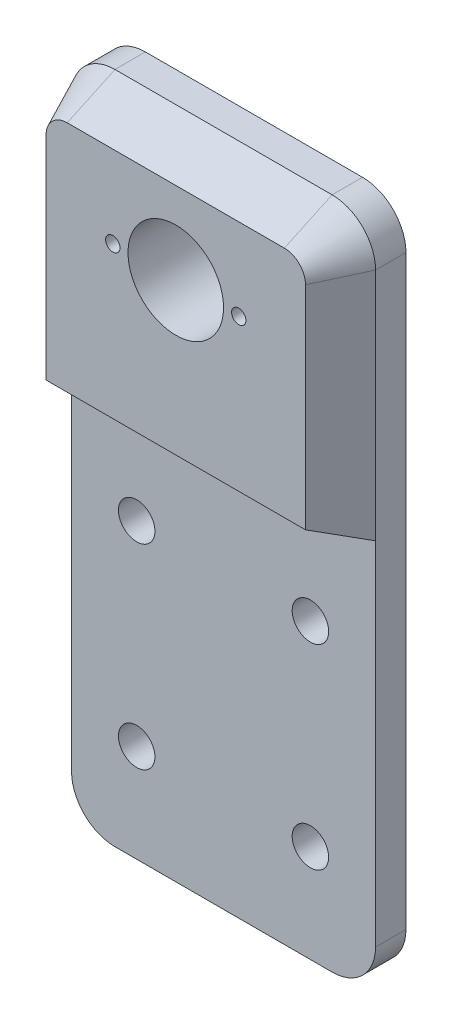
ISO-10303-21;
HEADER;
FILE_DESCRIPTION(('STEP AP214'),'2;1');
FILE_NAME('part.step','',(''),(''),'','','');
FILE_SCHEMA(('AUTOMOTIVE_DESIGN { 1 0 10303 214 1 1 1 1 }'));
ENDSEC;
DATA;
#1=APPLICATION_CONTEXT('core data for automotive mechanical design processes');
#2=APPLICATION_PROTOCOL_DEFINITION('international standard','automotive_design',2000,#1);
#3=PRODUCT_CONTEXT('',#1,'mechanical');
#4=PRODUCT('Part','Part','',(#3));
#5=PRODUCT_RELATED_PRODUCT_CATEGORY('part','',(#4));
#6=PRODUCT_DEFINITION_FORMATION('','',#4);
#7=PRODUCT_DEFINITION_CONTEXT('part definition',#1,'design');
#8=PRODUCT_DEFINITION('design','',#6,#7);
#9=PRODUCT_DEFINITION_SHAPE('','',#8);
#10=(LENGTH_UNIT() NAMED_UNIT(*) SI_UNIT(.MILLI.,.METRE.));
#11=(NAMED_UNIT(*) PLANE_ANGLE_UNIT() SI_UNIT($,.RADIAN.));
#12=(NAMED_UNIT(*) SI_UNIT($,.STERADIAN.) SOLID_ANGLE_UNIT());
#13=UNCERTAINTY_MEASURE_WITH_UNIT(LENGTH_MEASURE(1.E-05),#10,'distance_accuracy_value','');
#14=(GEOMETRIC_REPRESENTATION_CONTEXT(3) GLOBAL_UNCERTAINTY_ASSIGNED_CONTEXT((#13)) GLOBAL_UNIT_ASSIGNED_CONTEXT((#10,
#11,#12)) REPRESENTATION_CONTEXT('',''));
#15=CARTESIAN_POINT('',(0.,0.,0.));
#16=DIRECTION('',(0.,0.,1.));
#17=DIRECTION('',(1.,0.,0.));
#18=AXIS2_PLACEMENT_3D('',#15,#16,#17);
#19=CARTESIAN_POINT('',(-25.,70.,0.));
#20=DIRECTION('',(0.,0.,-1.));
#21=DIRECTION('',(-1.,0.,0.));
#22=AXIS2_PLACEMENT_3D('',#19,#20,#21);
#23=PLANE('',#22);
#24=CARTESIAN_POINT('',(-20.,-7.49999999999999,0.));
#25=DIRECTION('',(0.,0.,1.));
#26=DIRECTION('',(1.,0.,0.));
#27=AXIS2_PLACEMENT_3D('',#24,#25,#26);
#28=CIRCLE('',#27,4.2);
#29=CARTESIAN_POINT('',(-15.8,-7.49999999999999,0.));
#30=VERTEX_POINT('',#29);
#31=EDGE_CURVE('E248',#30,#30,#28,.T.);
#32=ORIENTED_EDGE('',*,*,#31,.F.);
#33=EDGE_LOOP('',(#32));
#34=FACE_BOUND('',#33,.T.);
#35=CARTESIAN_POINT('',(20.,-7.49999999999999,0.));
#36=DIRECTION('',(0.,0.,1.));
#37=DIRECTION('',(1.,0.,0.));
#38=AXIS2_PLACEMENT_3D('',#35,#36,#37);
#39=CIRCLE('',#38,4.2);
#40=CARTESIAN_POINT('',(24.2,-7.49999999999999,0.));
#41=VERTEX_POINT('',#40);
#42=EDGE_CURVE('E242',#41,#41,#39,.T.);
#43=ORIENTED_EDGE('',*,*,#42,.F.);
#44=EDGE_LOOP('',(#43));
#45=FACE_BOUND('',#44,.T.);
#46=CARTESIAN_POINT('',(20.,-52.5,0.));
#47=DIRECTION('',(0.,0.,1.));
#48=DIRECTION('',(1.,0.,0.));
#49=AXIS2_PLACEMENT_3D('',#46,#47,#48);
#50=CIRCLE('',#49,4.2);
#51=CARTESIAN_POINT('',(24.2,-52.5,0.));
#52=VERTEX_POINT('',#51);
#53=EDGE_CURVE('E235',#52,#52,#50,.T.);
#54=ORIENTED_EDGE('',*,*,#53,.F.);
#55=EDGE_LOOP('',(#54));
#56=FACE_BOUND('',#55,.T.);
#57=CARTESIAN_POINT('',(-20.,-52.5,0.));
#58=DIRECTION('',(0.,0.,1.));
#59=DIRECTION('',(1.,0.,0.));
#60=AXIS2_PLACEMENT_3D('',#57,#58,#59);
#61=CIRCLE('',#60,4.2);
#62=CARTESIAN_POINT('',(-15.8,-52.5,0.));
#63=VERTEX_POINT('',#62);
#64=EDGE_CURVE('E236',#63,#63,#61,.T.);
#65=ORIENTED_EDGE('',*,*,#64,.F.);
#66=EDGE_LOOP('',(#65));
#67=FACE_BOUND('',#66,.T.);
#68=DIRECTION('',(1.,0.,0.));
#69=VECTOR('',#68,1.);
#70=CARTESIAN_POINT('',(-35.,16.,0.));
#71=LINE('',#70,#69);
#72=CARTESIAN_POINT('',(-35.,16.,0.));
#73=VERTEX_POINT('',#72);
#74=CARTESIAN_POINT('',(35.,16.,0.));
#75=VERTEX_POINT('',#74);
#76=EDGE_CURVE('E58',#73,#75,#71,.T.);
#77=ORIENTED_EDGE('',*,*,#76,.F.);
#78=DIRECTION('',(0.,-1.,0.));
#79=VECTOR('',#78,1.);
#80=CARTESIAN_POINT('',(-35.,70.,0.));
#81=LINE('',#80,#79);
#82=CARTESIAN_POINT('',(-35.,-64.9999999999999,0.));
#83=VERTEX_POINT('',#82);
#84=EDGE_CURVE('E154',#73,#83,#81,.T.);
#85=ORIENTED_EDGE('',*,*,#84,.T.);
#86=CARTESIAN_POINT('',(-25.,-65.,0.));
#87=DIRECTION('',(0.,0.,1.));
#88=DIRECTION('',(-1.,0.,0.));
#89=AXIS2_PLACEMENT_3D('',#86,#87,#88);
#90=CIRCLE('',#89,10.);
#91=CARTESIAN_POINT('',(-24.9999999999999,-75.,0.));
#92=VERTEX_POINT('',#91);
#93=EDGE_CURVE('E159',#83,#92,#90,.T.);
#94=ORIENTED_EDGE('',*,*,#93,.T.);
#95=DIRECTION('',(1.,0.,0.));
#96=VECTOR('',#95,1.);
#97=CARTESIAN_POINT('',(-24.9999999999999,-75.,0.));
#98=LINE('',#97,#96);
#99=CARTESIAN_POINT('',(24.9999999999999,-75.,0.));
#100=VERTEX_POINT('',#99);
#101=EDGE_CURVE('E162',#92,#100,#98,.T.);
#102=ORIENTED_EDGE('',*,*,#101,.T.);
#103=CARTESIAN_POINT('',(25.,-65.,0.));
#104=DIRECTION('',(0.,0.,1.));
#105=DIRECTION('',(-1.,0.,0.));
#106=AXIS2_PLACEMENT_3D('',#103,#104,#105);
#107=CIRCLE('',#106,10.);
#108=CARTESIAN_POINT('',(35.,-64.9999999999999,0.));
#109=VERTEX_POINT('',#108);
#110=EDGE_CURVE('E165',#100,#109,#107,.T.);
#111=ORIENTED_EDGE('',*,*,#110,.T.);
#112=DIRECTION('',(0.,1.,0.));
#113=VECTOR('',#112,1.);
#114=CARTESIAN_POINT('',(35.,70.,0.));
#115=LINE('',#114,#113);
#116=EDGE_CURVE('E168',#109,#75,#115,.T.);
#117=ORIENTED_EDGE('',*,*,#116,.T.);
#118=EDGE_LOOP('',(#77,#85,#94,#102,#111,#117));
#119=FACE_BOUND('',#118,.T.);
#120=ADVANCED_FACE('F41',(#34,#45,#56,#67,#119),#23,.F.);
#121=CARTESIAN_POINT('',(-25.,70.,-7.));
#122=DIRECTION('',(0.,0.,1.));
#123=DIRECTION('',(1.,0.,0.));
#124=AXIS2_PLACEMENT_3D('',#121,#122,#123);
#125=CYLINDRICAL_SURFACE('',#124,10.);
#126=CARTESIAN_POINT('',(-25.,70.,0.));
#127=DIRECTION('',(0.,0.,1.));
#128=DIRECTION('',(-1.,0.,0.));
#129=AXIS2_PLACEMENT_3D('',#126,#127,#128);
#130=CIRCLE('',#129,10.);
#131=CARTESIAN_POINT('',(-25.,80.,0.));
#132=VERTEX_POINT('',#131);
#133=CARTESIAN_POINT('',(-35.,70.,0.));
#134=VERTEX_POINT('',#133);
#135=EDGE_CURVE('E151',#132,#134,#130,.T.);
#136=ORIENTED_EDGE('',*,*,#135,.F.);
#137=DIRECTION('',(0.,0.,1.));
#138=VECTOR('',#137,1.);
#139=CARTESIAN_POINT('',(-25.,80.,-7.));
#140=LINE('',#139,#138);
#141=CARTESIAN_POINT('',(-25.,80.,-7.));
#142=VERTEX_POINT('',#141);
#143=EDGE_CURVE('E11',#142,#132,#140,.T.);
#144=ORIENTED_EDGE('',*,*,#143,.F.);
#145=CARTESIAN_POINT('',(-25.,70.,-7.));
#146=DIRECTION('',(0.,0.,1.));
#147=DIRECTION('',(-1.,0.,0.));
#148=AXIS2_PLACEMENT_3D('',#145,#146,#147);
#149=CIRCLE('',#148,10.);
#150=CARTESIAN_POINT('',(-35.,70.,-7.));
#151=VERTEX_POINT('',#150);
#152=EDGE_CURVE('E173',#142,#151,#149,.T.);
#153=ORIENTED_EDGE('',*,*,#152,.T.);
#154=DIRECTION('',(0.,0.,1.));
#155=VECTOR('',#154,1.);
#156=CARTESIAN_POINT('',(-35.,70.,-7.));
#157=LINE('',#156,#155);
#158=EDGE_CURVE('E45',#151,#134,#157,.T.);
#159=ORIENTED_EDGE('',*,*,#158,.T.);
#160=EDGE_LOOP('',(#136,#144,#153,#159));
#161=FACE_BOUND('',#160,.T.);
#162=ADVANCED_FACE('F43',(#161),#125,.T.);
#163=CARTESIAN_POINT('',(-25.,80.,-7.));
#164=DIRECTION('',(0.,1.,0.));
#165=DIRECTION('',(0.,0.,1.));
#166=AXIS2_PLACEMENT_3D('',#163,#164,#165);
#167=PLANE('',#166);
#168=DIRECTION('',(-1.,0.,0.));
#169=VECTOR('',#168,1.);
#170=CARTESIAN_POINT('',(-25.,80.,0.));
#171=LINE('',#170,#169);
#172=CARTESIAN_POINT('',(25.,80.,0.));
#173=VERTEX_POINT('',#172);
#174=EDGE_CURVE('E171',#173,#132,#171,.T.);
#175=ORIENTED_EDGE('',*,*,#174,.F.);
#176=DIRECTION('',(0.,0.,1.));
#177=VECTOR('',#176,1.);
#178=CARTESIAN_POINT('',(25.,80.,-7.));
#179=LINE('',#178,#177);
#180=CARTESIAN_POINT('',(25.,80.,-7.));
#181=VERTEX_POINT('',#180);
#182=EDGE_CURVE('E50',#181,#173,#179,.T.);
#183=ORIENTED_EDGE('',*,*,#182,.F.);
#184=DIRECTION('',(-1.,0.,0.));
#185=VECTOR('',#184,1.);
#186=CARTESIAN_POINT('',(-25.,80.,-7.));
#187=LINE('',#186,#185);
#188=EDGE_CURVE('E140',#181,#142,#187,.T.);
#189=ORIENTED_EDGE('',*,*,#188,.T.);
#190=ORIENTED_EDGE('',*,*,#143,.T.);
#191=EDGE_LOOP('',(#175,#183,#189,#190));
#192=FACE_BOUND('',#191,.T.);
#193=ADVANCED_FACE('F299',(#192),#167,.T.);
#194=CARTESIAN_POINT('',(25.,70.,-7.));
#195=DIRECTION('',(0.,0.,1.));
#196=DIRECTION('',(1.,0.,0.));
#197=AXIS2_PLACEMENT_3D('',#194,#195,#196);
#198=CYLINDRICAL_SURFACE('',#197,9.99999999999999);
#199=CARTESIAN_POINT('',(25.,70.,0.));
#200=DIRECTION('',(0.,0.,1.));
#201=DIRECTION('',(1.,0.,0.));
#202=AXIS2_PLACEMENT_3D('',#199,#200,#201);
#203=CIRCLE('',#202,9.99999999999999);
#204=CARTESIAN_POINT('',(35.,70.,0.));
#205=VERTEX_POINT('',#204);
#206=EDGE_CURVE('E127',#205,#173,#203,.T.);
#207=ORIENTED_EDGE('',*,*,#206,.F.);
#208=DIRECTION('',(0.,0.,1.));
#209=VECTOR('',#208,1.);
#210=CARTESIAN_POINT('',(35.,70.,-7.));
#211=LINE('',#210,#209);
#212=CARTESIAN_POINT('',(35.,70.,-7.));
#213=VERTEX_POINT('',#212);
#214=EDGE_CURVE('E121',#213,#205,#211,.T.);
#215=ORIENTED_EDGE('',*,*,#214,.F.);
#216=CARTESIAN_POINT('',(25.,70.,-7.));
#217=DIRECTION('',(0.,0.,1.));
#218=DIRECTION('',(1.,0.,0.));
#219=AXIS2_PLACEMENT_3D('',#216,#217,#218);
#220=CIRCLE('',#219,9.99999999999999);
#221=EDGE_CURVE('E124',#213,#181,#220,.T.);
#222=ORIENTED_EDGE('',*,*,#221,.T.);
#223=ORIENTED_EDGE('',*,*,#182,.T.);
#224=EDGE_LOOP('',(#207,#215,#222,#223));
#225=FACE_BOUND('',#224,.T.);
#226=ADVANCED_FACE('F123',(#225),#198,.T.);
#227=CARTESIAN_POINT('',(35.,70.,-7.));
#228=DIRECTION('',(1.,0.,0.));
#229=DIRECTION('',(0.,1.,0.));
#230=AXIS2_PLACEMENT_3D('',#227,#228,#229);
#231=PLANE('',#230);
#232=ORIENTED_EDGE('',*,*,#116,.F.);
#233=DIRECTION('',(0.,0.,1.));
#234=VECTOR('',#233,1.);
#235=CARTESIAN_POINT('',(35.,-64.9999999999999,-7.));
#236=LINE('',#235,#234);
#237=CARTESIAN_POINT('',(35.,-64.9999999999999,-7.));
#238=VERTEX_POINT('',#237);
#239=EDGE_CURVE('E132',#238,#109,#236,.T.);
#240=ORIENTED_EDGE('',*,*,#239,.F.);
#241=DIRECTION('',(0.,1.,0.));
#242=VECTOR('',#241,1.);
#243=CARTESIAN_POINT('',(35.,70.,-7.));
#244=LINE('',#243,#242);
#245=EDGE_CURVE('E138',#238,#213,#244,.T.);
#246=ORIENTED_EDGE('',*,*,#245,.T.);
#247=ORIENTED_EDGE('',*,*,#214,.T.);
#248=DIRECTION('',(0.,1.,0.));
#249=VECTOR('',#248,1.);
#250=CARTESIAN_POINT('',(35.,70.,0.));
#251=LINE('',#250,#249);
#252=EDGE_CURVE('E221',#75,#205,#251,.T.);
#253=ORIENTED_EDGE('',*,*,#252,.F.);
#254=EDGE_LOOP('',(#232,#240,#246,#247,#253));
#255=FACE_BOUND('',#254,.T.);
#256=ADVANCED_FACE('F143',(#255),#231,.T.);
#257=CARTESIAN_POINT('',(25.,-65.,-7.));
#258=DIRECTION('',(0.,0.,1.));
#259=DIRECTION('',(1.,0.,0.));
#260=AXIS2_PLACEMENT_3D('',#257,#258,#259);
#261=CYLINDRICAL_SURFACE('',#260,10.);
#262=ORIENTED_EDGE('',*,*,#110,.F.);
#263=DIRECTION('',(0.,0.,1.));
#264=VECTOR('',#263,1.);
#265=CARTESIAN_POINT('',(24.9999999999999,-75.,-7.));
#266=LINE('',#265,#264);
#267=CARTESIAN_POINT('',(24.9999999999999,-75.,-7.));
#268=VERTEX_POINT('',#267);
#269=EDGE_CURVE('E177',#268,#100,#266,.T.);
#270=ORIENTED_EDGE('',*,*,#269,.F.);
#271=CARTESIAN_POINT('',(25.,-65.,-7.));
#272=DIRECTION('',(0.,0.,1.));
#273=DIRECTION('',(-1.,0.,0.));
#274=AXIS2_PLACEMENT_3D('',#271,#272,#273);
#275=CIRCLE('',#274,10.);
#276=EDGE_CURVE('E144',#268,#238,#275,.T.);
#277=ORIENTED_EDGE('',*,*,#276,.T.);
#278=ORIENTED_EDGE('',*,*,#239,.T.);
#279=EDGE_LOOP('',(#262,#270,#277,#278));
#280=FACE_BOUND('',#279,.T.);
#281=ADVANCED_FACE('F271',(#280),#261,.T.);
#282=CARTESIAN_POINT('',(-24.9999999999999,-75.,-7.));
#283=DIRECTION('',(0.,-1.,0.));
#284=DIRECTION('',(0.,0.,-1.));
#285=AXIS2_PLACEMENT_3D('',#282,#283,#284);
#286=PLANE('',#285);
#287=ORIENTED_EDGE('',*,*,#101,.F.);
#288=DIRECTION('',(0.,0.,1.));
#289=VECTOR('',#288,1.);
#290=CARTESIAN_POINT('',(-24.9999999999999,-75.,-7.));
#291=LINE('',#290,#289);
#292=CARTESIAN_POINT('',(-24.9999999999999,-75.,-7.));
#293=VERTEX_POINT('',#292);
#294=EDGE_CURVE('E179',#293,#92,#291,.T.);
#295=ORIENTED_EDGE('',*,*,#294,.F.);
#296=DIRECTION('',(1.,0.,0.));
#297=VECTOR('',#296,1.);
#298=CARTESIAN_POINT('',(-24.9999999999999,-75.,-7.));
#299=LINE('',#298,#297);
#300=EDGE_CURVE('E146',#293,#268,#299,.T.);
#301=ORIENTED_EDGE('',*,*,#300,.T.);
#302=ORIENTED_EDGE('',*,*,#269,.T.);
#303=EDGE_LOOP('',(#287,#295,#301,#302));
#304=FACE_BOUND('',#303,.T.);
#305=ADVANCED_FACE('F264',(#304),#286,.T.);
#306=CARTESIAN_POINT('',(-25.,-65.,-7.));
#307=DIRECTION('',(0.,0.,1.));
#308=DIRECTION('',(1.,0.,0.));
#309=AXIS2_PLACEMENT_3D('',#306,#307,#308);
#310=CYLINDRICAL_SURFACE('',#309,10.);
#311=ORIENTED_EDGE('',*,*,#93,.F.);
#312=DIRECTION('',(0.,0.,1.));
#313=VECTOR('',#312,1.);
#314=CARTESIAN_POINT('',(-35.,-64.9999999999999,-7.));
#315=LINE('',#314,#313);
#316=CARTESIAN_POINT('',(-35.,-64.9999999999999,-7.));
#317=VERTEX_POINT('',#316);
#318=EDGE_CURVE('E180',#317,#83,#315,.T.);
#319=ORIENTED_EDGE('',*,*,#318,.F.);
#320=CARTESIAN_POINT('',(-25.,-65.,-7.));
#321=DIRECTION('',(0.,0.,1.));
#322=DIRECTION('',(-1.,0.,0.));
#323=AXIS2_PLACEMENT_3D('',#320,#321,#322);
#324=CIRCLE('',#323,10.);
#325=EDGE_CURVE('E258',#317,#293,#324,.T.);
#326=ORIENTED_EDGE('',*,*,#325,.T.);
#327=ORIENTED_EDGE('',*,*,#294,.T.);
#328=EDGE_LOOP('',(#311,#319,#326,#327));
#329=FACE_BOUND('',#328,.T.);
#330=ADVANCED_FACE('F268',(#329),#310,.T.);
#331=CARTESIAN_POINT('',(-35.,70.,-7.));
#332=DIRECTION('',(-1.,0.,0.));
#333=DIRECTION('',(0.,-1.,0.));
#334=AXIS2_PLACEMENT_3D('',#331,#332,#333);
#335=PLANE('',#334);
#336=EDGE_CURVE('E156',#134,#73,#81,.T.);
#337=ORIENTED_EDGE('',*,*,#336,.F.);
#338=ORIENTED_EDGE('',*,*,#158,.F.);
#339=DIRECTION('',(0.,-1.,0.));
#340=VECTOR('',#339,1.);
#341=CARTESIAN_POINT('',(-35.,70.,-7.));
#342=LINE('',#341,#340);
#343=EDGE_CURVE('E256',#151,#317,#342,.T.);
#344=ORIENTED_EDGE('',*,*,#343,.T.);
#345=ORIENTED_EDGE('',*,*,#318,.T.);
#346=ORIENTED_EDGE('',*,*,#84,.F.);
#347=EDGE_LOOP('',(#337,#338,#344,#345,#346));
#348=FACE_BOUND('',#347,.T.);
#349=ADVANCED_FACE('F183',(#348),#335,.T.);
#350=CARTESIAN_POINT('',(-25.,70.,-7.));
#351=DIRECTION('',(0.,0.,-1.));
#352=DIRECTION('',(-1.,0.,0.));
#353=AXIS2_PLACEMENT_3D('',#350,#351,#352);
#354=PLANE('',#353);
#355=CARTESIAN_POINT('',(-14.5,56.,-7.));
#356=DIRECTION('',(0.,0.,1.));
#357=DIRECTION('',(1.,0.,0.));
#358=AXIS2_PLACEMENT_3D('',#355,#356,#357);
#359=CIRCLE('',#358,1.65);
#360=CARTESIAN_POINT('',(-12.85,56.,-7.));
#361=VERTEX_POINT('',#360);
#362=EDGE_CURVE('E282',#361,#361,#359,.T.);
#363=ORIENTED_EDGE('',*,*,#362,.T.);
#364=EDGE_LOOP('',(#363));
#365=FACE_BOUND('',#364,.T.);
#366=CARTESIAN_POINT('',(14.5,56.,-7.));
#367=DIRECTION('',(0.,0.,1.));
#368=DIRECTION('',(1.,0.,0.));
#369=AXIS2_PLACEMENT_3D('',#366,#367,#368);
#370=CIRCLE('',#369,1.65);
#371=CARTESIAN_POINT('',(16.15,56.,-7.));
#372=VERTEX_POINT('',#371);
#373=EDGE_CURVE('E353',#372,#372,#370,.T.);
#374=ORIENTED_EDGE('',*,*,#373,.T.);
#375=EDGE_LOOP('',(#374));
#376=FACE_BOUND('',#375,.T.);
#377=CARTESIAN_POINT('',(0.,56.,-7.));
#378=DIRECTION('',(0.,0.,1.));
#379=DIRECTION('',(1.,0.,0.));
#380=AXIS2_PLACEMENT_3D('',#377,#378,#379);
#381=CIRCLE('',#380,11.);
#382=CARTESIAN_POINT('',(11.,56.,-7.));
#383=VERTEX_POINT('',#382);
#384=EDGE_CURVE('E357',#383,#383,#381,.T.);
#385=ORIENTED_EDGE('',*,*,#384,.T.);
#386=EDGE_LOOP('',(#385));
#387=FACE_BOUND('',#386,.T.);
#388=CARTESIAN_POINT('',(-20.,-52.5,-7.));
#389=DIRECTION('',(0.,0.,1.));
#390=DIRECTION('',(1.,0.,0.));
#391=AXIS2_PLACEMENT_3D('',#388,#389,#390);
#392=CIRCLE('',#391,4.2);
#393=CARTESIAN_POINT('',(-15.8,-52.5,-7.));
#394=VERTEX_POINT('',#393);
#395=EDGE_CURVE('E232',#394,#394,#392,.T.);
#396=ORIENTED_EDGE('',*,*,#395,.T.);
#397=EDGE_LOOP('',(#396));
#398=FACE_BOUND('',#397,.T.);
#399=CARTESIAN_POINT('',(20.,-52.5,-7.));
#400=DIRECTION('',(0.,0.,1.));
#401=DIRECTION('',(1.,0.,0.));
#402=AXIS2_PLACEMENT_3D('',#399,#400,#401);
#403=CIRCLE('',#402,4.2);
#404=CARTESIAN_POINT('',(24.2,-52.5,-7.));
#405=VERTEX_POINT('',#404);
#406=EDGE_CURVE('E239',#405,#405,#403,.T.);
#407=ORIENTED_EDGE('',*,*,#406,.T.);
#408=EDGE_LOOP('',(#407));
#409=FACE_BOUND('',#408,.T.);
#410=CARTESIAN_POINT('',(20.,-7.49999999999999,-7.));
#411=DIRECTION('',(0.,0.,1.));
#412=DIRECTION('',(1.,0.,0.));
#413=AXIS2_PLACEMENT_3D('',#410,#411,#412);
#414=CIRCLE('',#413,4.2);
#415=CARTESIAN_POINT('',(24.2,-7.49999999999999,-7.));
#416=VERTEX_POINT('',#415);
#417=EDGE_CURVE('E245',#416,#416,#414,.T.);
#418=ORIENTED_EDGE('',*,*,#417,.T.);
#419=EDGE_LOOP('',(#418));
#420=FACE_BOUND('',#419,.T.);
#421=CARTESIAN_POINT('',(-20.,-7.49999999999999,-7.));
#422=DIRECTION('',(0.,0.,1.));
#423=DIRECTION('',(1.,0.,0.));
#424=AXIS2_PLACEMENT_3D('',#421,#422,#423);
#425=CIRCLE('',#424,4.2);
#426=CARTESIAN_POINT('',(-15.8,-7.49999999999999,-7.));
#427=VERTEX_POINT('',#426);
#428=EDGE_CURVE('E155',#427,#427,#425,.T.);
#429=ORIENTED_EDGE('',*,*,#428,.T.);
#430=EDGE_LOOP('',(#429));
#431=FACE_BOUND('',#430,.T.);
#432=ORIENTED_EDGE('',*,*,#152,.F.);
#433=ORIENTED_EDGE('',*,*,#188,.F.);
#434=ORIENTED_EDGE('',*,*,#221,.F.);
#435=ORIENTED_EDGE('',*,*,#245,.F.);
#436=ORIENTED_EDGE('',*,*,#276,.F.);
#437=ORIENTED_EDGE('',*,*,#300,.F.);
#438=ORIENTED_EDGE('',*,*,#325,.F.);
#439=ORIENTED_EDGE('',*,*,#343,.F.);
#440=EDGE_LOOP('',(#432,#433,#434,#435,#436,#437,#438,#439));
#441=FACE_BOUND('',#440,.T.);
#442=ADVANCED_FACE('F136',(#365,#376,#387,#398,#409,#420,#431,#441),#354,.T.);
#443=CARTESIAN_POINT('',(-20.,-7.49999999999999,-7.));
#444=DIRECTION('',(0.,0.,1.));
#445=DIRECTION('',(1.,0.,0.));
#446=AXIS2_PLACEMENT_3D('',#443,#444,#445);
#447=CYLINDRICAL_SURFACE('',#446,4.2);
#448=ORIENTED_EDGE('',*,*,#428,.F.);
#449=EDGE_LOOP('',(#448));
#450=FACE_BOUND('',#449,.T.);
#451=ORIENTED_EDGE('',*,*,#31,.T.);
#452=EDGE_LOOP('',(#451));
#453=FACE_BOUND('',#452,.T.);
#454=ADVANCED_FACE('F338',(#450,#453),#447,.F.);
#455=CARTESIAN_POINT('',(20.,-7.49999999999999,-7.));
#456=DIRECTION('',(0.,0.,1.));
#457=DIRECTION('',(1.,0.,0.));
#458=AXIS2_PLACEMENT_3D('',#455,#456,#457);
#459=CYLINDRICAL_SURFACE('',#458,4.2);
#460=ORIENTED_EDGE('',*,*,#417,.F.);
#461=EDGE_LOOP('',(#460));
#462=FACE_BOUND('',#461,.T.);
#463=ORIENTED_EDGE('',*,*,#42,.T.);
#464=EDGE_LOOP('',(#463));
#465=FACE_BOUND('',#464,.T.);
#466=ADVANCED_FACE('F345',(#462,#465),#459,.F.);
#467=CARTESIAN_POINT('',(20.,-52.5,-7.));
#468=DIRECTION('',(0.,0.,1.));
#469=DIRECTION('',(1.,0.,0.));
#470=AXIS2_PLACEMENT_3D('',#467,#468,#469);
#471=CYLINDRICAL_SURFACE('',#470,4.2);
#472=ORIENTED_EDGE('',*,*,#406,.F.);
#473=EDGE_LOOP('',(#472));
#474=FACE_BOUND('',#473,.T.);
#475=ORIENTED_EDGE('',*,*,#53,.T.);
#476=EDGE_LOOP('',(#475));
#477=FACE_BOUND('',#476,.T.);
#478=ADVANCED_FACE('F369',(#474,#477),#471,.F.);
#479=CARTESIAN_POINT('',(-20.,-52.5,-7.));
#480=DIRECTION('',(0.,0.,1.));
#481=DIRECTION('',(1.,0.,0.));
#482=AXIS2_PLACEMENT_3D('',#479,#480,#481);
#483=CYLINDRICAL_SURFACE('',#482,4.2);
#484=ORIENTED_EDGE('',*,*,#395,.F.);
#485=EDGE_LOOP('',(#484));
#486=FACE_BOUND('',#485,.T.);
#487=ORIENTED_EDGE('',*,*,#64,.T.);
#488=EDGE_LOOP('',(#487));
#489=FACE_BOUND('',#488,.T.);
#490=ADVANCED_FACE('F377',(#486,#489),#483,.F.);
#491=CARTESIAN_POINT('',(-35.,16.,0.));
#492=DIRECTION('',(-0.90630778703665,0.,0.4226182617407));
#493=DIRECTION('',(0.4226182617407,0.,0.90630778703665));
#494=AXIS2_PLACEMENT_3D('',#491,#492,#493);
#495=PLANE('',#494);
#496=ORIENTED_EDGE('',*,*,#336,.T.);
#497=DIRECTION('',(-0.389281620635026,-0.389281620635026,-0.834817129478987));
#498=VECTOR('',#497,1.);
#499=CARTESIAN_POINT('',(-35.,16.,0.));
#500=LINE('',#499,#498);
#501=CARTESIAN_POINT('',(-29.870615760295,21.129384239705,11.));
#502=VERTEX_POINT('',#501);
#503=EDGE_CURVE('E208',#502,#73,#500,.T.);
#504=ORIENTED_EDGE('',*,*,#503,.F.);
#505=DIRECTION('',(0.,1.,0.));
#506=VECTOR('',#505,1.);
#507=CARTESIAN_POINT('',(-29.870615760295,70.,11.));
#508=LINE('',#507,#506);
#509=CARTESIAN_POINT('',(-29.870615760295,70.,11.));
#510=VERTEX_POINT('',#509);
#511=EDGE_CURVE('E199',#510,#502,#508,.F.);
#512=ORIENTED_EDGE('',*,*,#511,.F.);
#513=DIRECTION('',(-0.4226182617407,0.,-0.90630778703665));
#514=VECTOR('',#513,1.);
#515=CARTESIAN_POINT('',(-35.,70.,0.));
#516=LINE('',#515,#514);
#517=EDGE_CURVE('E193',#510,#134,#516,.T.);
#518=ORIENTED_EDGE('',*,*,#517,.T.);
#519=EDGE_LOOP('',(#496,#504,#512,#518));
#520=FACE_BOUND('',#519,.T.);
#521=ADVANCED_FACE('F197',(#520),#495,.T.);
#522=CARTESIAN_POINT('',(-35.,16.,0.));
#523=DIRECTION('',(0.,-0.90630778703665,0.4226182617407));
#524=DIRECTION('',(0.,-0.4226182617407,-0.90630778703665));
#525=AXIS2_PLACEMENT_3D('',#522,#523,#524);
#526=PLANE('',#525);
#527=ORIENTED_EDGE('',*,*,#76,.T.);
#528=DIRECTION('',(0.389281620635026,-0.389281620635026,-0.834817129478987));
#529=VECTOR('',#528,1.);
#530=CARTESIAN_POINT('',(26.8168302711315,24.1831697288685,17.5488641152629));
#531=LINE('',#530,#529);
#532=CARTESIAN_POINT('',(29.870615760295,21.129384239705,11.));
#533=VERTEX_POINT('',#532);
#534=EDGE_CURVE('E216',#533,#75,#531,.T.);
#535=ORIENTED_EDGE('',*,*,#534,.F.);
#536=DIRECTION('',(-1.,0.,0.));
#537=VECTOR('',#536,1.);
#538=CARTESIAN_POINT('',(-25.,21.129384239705,11.));
#539=LINE('',#538,#537);
#540=EDGE_CURVE('E220',#502,#533,#539,.F.);
#541=ORIENTED_EDGE('',*,*,#540,.F.);
#542=ORIENTED_EDGE('',*,*,#503,.T.);
#543=EDGE_LOOP('',(#527,#535,#541,#542));
#544=FACE_BOUND('',#543,.T.);
#545=ADVANCED_FACE('F278',(#544),#526,.T.);
#546=CARTESIAN_POINT('',(35.,70.,0.));
#547=DIRECTION('',(0.90630778703665,0.,0.4226182617407));
#548=DIRECTION('',(0.4226182617407,0.,-0.90630778703665));
#549=AXIS2_PLACEMENT_3D('',#546,#547,#548);
#550=PLANE('',#549);
#551=ORIENTED_EDGE('',*,*,#252,.T.);
#552=DIRECTION('',(0.4226182617407,0.,-0.90630778703665));
#553=VECTOR('',#552,1.);
#554=CARTESIAN_POINT('',(35.,70.,0.));
#555=LINE('',#554,#553);
#556=CARTESIAN_POINT('',(29.870615760295,70.,11.));
#557=VERTEX_POINT('',#556);
#558=EDGE_CURVE('E213',#557,#205,#555,.T.);
#559=ORIENTED_EDGE('',*,*,#558,.F.);
#560=DIRECTION('',(0.,-1.,0.));
#561=VECTOR('',#560,1.);
#562=CARTESIAN_POINT('',(29.870615760295,70.,11.));
#563=LINE('',#562,#561);
#564=EDGE_CURVE('E224',#533,#557,#563,.F.);
#565=ORIENTED_EDGE('',*,*,#564,.F.);
#566=ORIENTED_EDGE('',*,*,#534,.T.);
#567=EDGE_LOOP('',(#551,#559,#565,#566));
#568=FACE_BOUND('',#567,.T.);
#569=ADVANCED_FACE('F284',(#568),#550,.T.);
#570=CARTESIAN_POINT('',(25.,70.,0.));
#571=DIRECTION('',(0.,0.,-1.));
#572=DIRECTION('',(-1.,0.,0.));
#573=AXIS2_PLACEMENT_3D('',#570,#571,#572);
#574=CONICAL_SURFACE('',#573,10.,0.436332312998583);
#575=ORIENTED_EDGE('',*,*,#206,.T.);
#576=DIRECTION('',(0.,0.4226182617407,-0.90630778703665));
#577=VECTOR('',#576,1.);
#578=CARTESIAN_POINT('',(25.,80.,0.));
#579=LINE('',#578,#577);
#580=CARTESIAN_POINT('',(25.,74.870615760295,11.));
#581=VERTEX_POINT('',#580);
#582=EDGE_CURVE('E202',#581,#173,#579,.T.);
#583=ORIENTED_EDGE('',*,*,#582,.F.);
#584=CARTESIAN_POINT('',(25.,70.,11.));
#585=DIRECTION('',(0.,0.,-1.));
#586=DIRECTION('',(-1.,0.,0.));
#587=AXIS2_PLACEMENT_3D('',#584,#585,#586);
#588=CIRCLE('',#587,4.870615760295);
#589=EDGE_CURVE('E227',#557,#581,#588,.F.);
#590=ORIENTED_EDGE('',*,*,#589,.F.);
#591=ORIENTED_EDGE('',*,*,#558,.T.);
#592=EDGE_LOOP('',(#575,#583,#590,#591));
#593=FACE_BOUND('',#592,.T.);
#594=ADVANCED_FACE('F301',(#593),#574,.T.);
#595=CARTESIAN_POINT('',(-24.9999999999999,80.,0.));
#596=DIRECTION('',(0.,0.906307787036649,0.4226182617407));
#597=DIRECTION('',(0.,-0.4226182617407,0.90630778703665));
#598=AXIS2_PLACEMENT_3D('',#595,#596,#597);
#599=PLANE('',#598);
#600=ORIENTED_EDGE('',*,*,#174,.T.);
#601=DIRECTION('',(0.,0.4226182617407,-0.90630778703665));
#602=VECTOR('',#601,1.);
#603=CARTESIAN_POINT('',(-24.9999999999999,80.,0.));
#604=LINE('',#603,#602);
#605=CARTESIAN_POINT('',(-25.,74.870615760295,11.));
#606=VERTEX_POINT('',#605);
#607=EDGE_CURVE('E196',#606,#132,#604,.T.);
#608=ORIENTED_EDGE('',*,*,#607,.F.);
#609=DIRECTION('',(1.,0.,0.));
#610=VECTOR('',#609,1.);
#611=CARTESIAN_POINT('',(-25.,74.870615760295,11.));
#612=LINE('',#611,#610);
#613=EDGE_CURVE('E205',#581,#606,#612,.F.);
#614=ORIENTED_EDGE('',*,*,#613,.F.);
#615=ORIENTED_EDGE('',*,*,#582,.T.);
#616=EDGE_LOOP('',(#600,#608,#614,#615));
#617=FACE_BOUND('',#616,.T.);
#618=ADVANCED_FACE('F298',(#617),#599,.T.);
#619=CARTESIAN_POINT('',(-25.,70.,0.));
#620=DIRECTION('',(0.,0.,-1.));
#621=DIRECTION('',(-1.,0.,0.));
#622=AXIS2_PLACEMENT_3D('',#619,#620,#621);
#623=CONICAL_SURFACE('',#622,10.,0.436332312998583);
#624=ORIENTED_EDGE('',*,*,#135,.T.);
#625=ORIENTED_EDGE('',*,*,#517,.F.);
#626=CARTESIAN_POINT('',(-25.,70.,11.));
#627=DIRECTION('',(0.,0.,-1.));
#628=DIRECTION('',(-1.,0.,0.));
#629=AXIS2_PLACEMENT_3D('',#626,#627,#628);
#630=CIRCLE('',#629,4.870615760295);
#631=EDGE_CURVE('E200',#606,#510,#630,.F.);
#632=ORIENTED_EDGE('',*,*,#631,.F.);
#633=ORIENTED_EDGE('',*,*,#607,.T.);
#634=EDGE_LOOP('',(#624,#625,#632,#633));
#635=FACE_BOUND('',#634,.T.);
#636=ADVANCED_FACE('F191',(#635),#623,.T.);
#637=CARTESIAN_POINT('',(-25.,70.,11.));
#638=DIRECTION('',(0.,0.,-1.));
#639=DIRECTION('',(-1.,0.,0.));
#640=AXIS2_PLACEMENT_3D('',#637,#638,#639);
#641=PLANE('',#640);
#642=CARTESIAN_POINT('',(-14.5,56.,11.));
#643=DIRECTION('',(0.,0.,1.));
#644=DIRECTION('',(1.,0.,0.));
#645=AXIS2_PLACEMENT_3D('',#642,#643,#644);
#646=CIRCLE('',#645,1.65);
#647=CARTESIAN_POINT('',(-12.85,56.,11.));
#648=VERTEX_POINT('',#647);
#649=EDGE_CURVE('E459',#648,#648,#646,.T.);
#650=ORIENTED_EDGE('',*,*,#649,.F.);
#651=EDGE_LOOP('',(#650));
#652=FACE_BOUND('',#651,.T.);
#653=CARTESIAN_POINT('',(14.5,56.,11.));
#654=DIRECTION('',(0.,0.,1.));
#655=DIRECTION('',(1.,0.,0.));
#656=AXIS2_PLACEMENT_3D('',#653,#654,#655);
#657=CIRCLE('',#656,1.65);
#658=CARTESIAN_POINT('',(16.15,56.,11.));
#659=VERTEX_POINT('',#658);
#660=EDGE_CURVE('E460',#659,#659,#657,.T.);
#661=ORIENTED_EDGE('',*,*,#660,.F.);
#662=EDGE_LOOP('',(#661));
#663=FACE_BOUND('',#662,.T.);
#664=CARTESIAN_POINT('',(0.,56.,11.));
#665=DIRECTION('',(0.,0.,1.));
#666=DIRECTION('',(1.,0.,0.));
#667=AXIS2_PLACEMENT_3D('',#664,#665,#666);
#668=CIRCLE('',#667,11.);
#669=CARTESIAN_POINT('',(11.,56.,11.));
#670=VERTEX_POINT('',#669);
#671=EDGE_CURVE('E467',#670,#670,#668,.T.);
#672=ORIENTED_EDGE('',*,*,#671,.F.);
#673=EDGE_LOOP('',(#672));
#674=FACE_BOUND('',#673,.T.);
#675=ORIENTED_EDGE('',*,*,#511,.T.);
#676=ORIENTED_EDGE('',*,*,#540,.T.);
#677=ORIENTED_EDGE('',*,*,#564,.T.);
#678=ORIENTED_EDGE('',*,*,#589,.T.);
#679=ORIENTED_EDGE('',*,*,#613,.T.);
#680=ORIENTED_EDGE('',*,*,#631,.T.);
#681=EDGE_LOOP('',(#675,#676,#677,#678,#679,#680));
#682=FACE_BOUND('',#681,.T.);
#683=ADVANCED_FACE('F289',(#652,#663,#674,#682),#641,.F.);
#684=CARTESIAN_POINT('',(0.,56.,-7.));
#685=DIRECTION('',(0.,0.,1.));
#686=DIRECTION('',(1.,0.,0.));
#687=AXIS2_PLACEMENT_3D('',#684,#685,#686);
#688=CYLINDRICAL_SURFACE('',#687,11.);
#689=ORIENTED_EDGE('',*,*,#384,.F.);
#690=EDGE_LOOP('',(#689));
#691=FACE_BOUND('',#690,.T.);
#692=ORIENTED_EDGE('',*,*,#671,.T.);
#693=EDGE_LOOP('',(#692));
#694=FACE_BOUND('',#693,.T.);
#695=ADVANCED_FACE('F423',(#691,#694),#688,.F.);
#696=CARTESIAN_POINT('',(14.5,56.,-7.));
#697=DIRECTION('',(0.,0.,1.));
#698=DIRECTION('',(1.,0.,0.));
#699=AXIS2_PLACEMENT_3D('',#696,#697,#698);
#700=CYLINDRICAL_SURFACE('',#699,1.65);
#701=ORIENTED_EDGE('',*,*,#373,.F.);
#702=EDGE_LOOP('',(#701));
#703=FACE_BOUND('',#702,.T.);
#704=ORIENTED_EDGE('',*,*,#660,.T.);
#705=EDGE_LOOP('',(#704));
#706=FACE_BOUND('',#705,.T.);
#707=ADVANCED_FACE('F433',(#703,#706),#700,.F.);
#708=CARTESIAN_POINT('',(-14.5,56.,-7.));
#709=DIRECTION('',(0.,0.,1.));
#710=DIRECTION('',(1.,0.,0.));
#711=AXIS2_PLACEMENT_3D('',#708,#709,#710);
#712=CYLINDRICAL_SURFACE('',#711,1.65);
#713=ORIENTED_EDGE('',*,*,#362,.F.);
#714=EDGE_LOOP('',(#713));
#715=FACE_BOUND('',#714,.T.);
#716=ORIENTED_EDGE('',*,*,#649,.T.);
#717=EDGE_LOOP('',(#716));
#718=FACE_BOUND('',#717,.T.);
#719=ADVANCED_FACE('F443',(#715,#718),#712,.F.);
#720=CLOSED_SHELL('',(#120,#162,#193,#226,#256,#281,#305,#330,#349,#442,#454,#466,#478,#490,
#521,#545,#569,#594,#618,#636,#683,#695,#707,#719));
#721=MANIFOLD_SOLID_BREP('B2',#720);
#722=ADVANCED_BREP_SHAPE_REPRESENTATION('',(#18,#721),#14);
#723=SHAPE_DEFINITION_REPRESENTATION(#9,#722);
ENDSEC;
END-ISO-10303-21;
